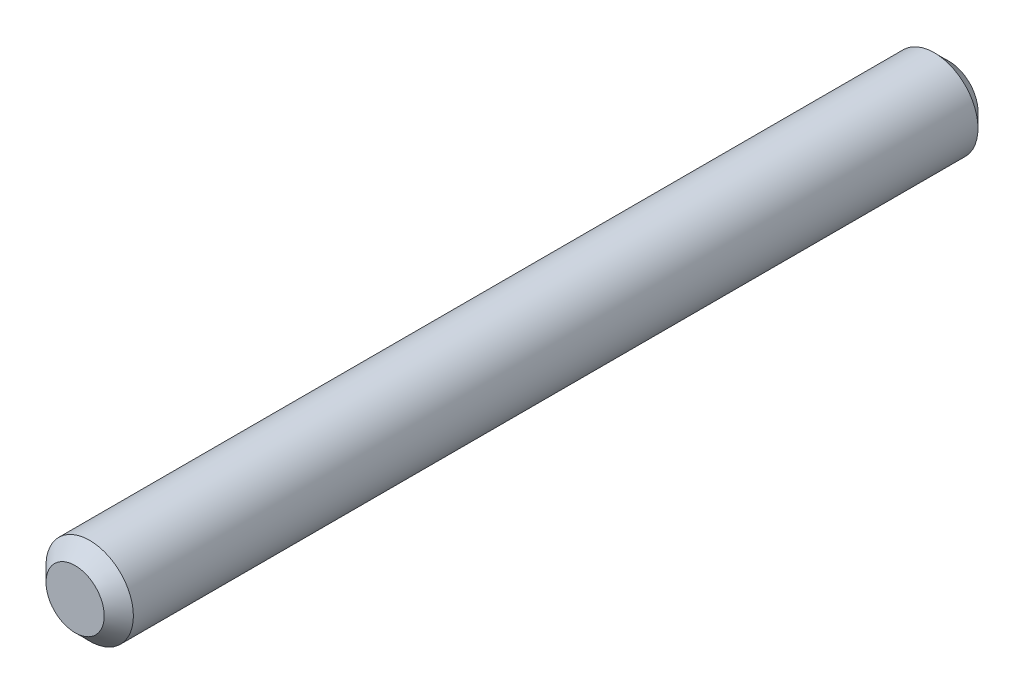
ISO-10303-21;
HEADER;
FILE_DESCRIPTION(('STEP AP214'),'2;1');
FILE_NAME('part.step','',(''),(''),'','','');
FILE_SCHEMA(('AUTOMOTIVE_DESIGN { 1 0 10303 214 1 1 1 1 }'));
ENDSEC;
DATA;
#1=APPLICATION_CONTEXT('core data for automotive mechanical design processes');
#2=APPLICATION_PROTOCOL_DEFINITION('international standard','automotive_design',2000,#1);
#3=PRODUCT_CONTEXT('',#1,'mechanical');
#4=PRODUCT('Part','Part','',(#3));
#5=PRODUCT_RELATED_PRODUCT_CATEGORY('part','',(#4));
#6=PRODUCT_DEFINITION_FORMATION('','',#4);
#7=PRODUCT_DEFINITION_CONTEXT('part definition',#1,'design');
#8=PRODUCT_DEFINITION('design','',#6,#7);
#9=PRODUCT_DEFINITION_SHAPE('','',#8);
#10=(LENGTH_UNIT() NAMED_UNIT(*) SI_UNIT(.MILLI.,.METRE.));
#11=(NAMED_UNIT(*) PLANE_ANGLE_UNIT() SI_UNIT($,.RADIAN.));
#12=(NAMED_UNIT(*) SI_UNIT($,.STERADIAN.) SOLID_ANGLE_UNIT());
#13=UNCERTAINTY_MEASURE_WITH_UNIT(LENGTH_MEASURE(1.E-05),#10,'distance_accuracy_value','');
#14=(GEOMETRIC_REPRESENTATION_CONTEXT(3) GLOBAL_UNCERTAINTY_ASSIGNED_CONTEXT((#13)) GLOBAL_UNIT_ASSIGNED_CONTEXT((#10,
#11,#12)) REPRESENTATION_CONTEXT('',''));
#15=CARTESIAN_POINT('',(0.,0.,0.));
#16=DIRECTION('',(0.,0.,1.));
#17=DIRECTION('',(1.,0.,0.));
#18=AXIS2_PLACEMENT_3D('',#15,#16,#17);
#19=CARTESIAN_POINT('',(0.,0.,30.));
#20=DIRECTION('',(0.,0.,-1.));
#21=DIRECTION('',(-1.,0.,0.));
#22=AXIS2_PLACEMENT_3D('',#19,#20,#21);
#23=CYLINDRICAL_SURFACE('',#22,3.);
#24=CARTESIAN_POINT('',(0.,0.,-29.));
#25=DIRECTION('',(0.,0.,1.));
#26=DIRECTION('',(1.,0.,0.));
#27=AXIS2_PLACEMENT_3D('',#24,#25,#26);
#28=CIRCLE('',#27,3.);
#29=CARTESIAN_POINT('',(3.,0.,-29.));
#30=VERTEX_POINT('',#29);
#31=EDGE_CURVE('E53',#30,#30,#28,.T.);
#32=ORIENTED_EDGE('',*,*,#31,.T.);
#33=EDGE_LOOP('',(#32));
#34=FACE_BOUND('',#33,.T.);
#35=CARTESIAN_POINT('',(0.,0.,29.));
#36=DIRECTION('',(0.,0.,1.));
#37=DIRECTION('',(1.,0.,0.));
#38=AXIS2_PLACEMENT_3D('',#35,#36,#37);
#39=CIRCLE('',#38,3.);
#40=CARTESIAN_POINT('',(3.,0.,29.));
#41=VERTEX_POINT('',#40);
#42=EDGE_CURVE('E59',#41,#41,#39,.F.);
#43=ORIENTED_EDGE('',*,*,#42,.T.);
#44=EDGE_LOOP('',(#43));
#45=FACE_BOUND('',#44,.T.);
#46=ADVANCED_FACE('F44',(#34,#45),#23,.T.);
#47=CARTESIAN_POINT('',(0.,0.,30.));
#48=DIRECTION('',(0.,0.,1.));
#49=DIRECTION('',(1.,0.,0.));
#50=AXIS2_PLACEMENT_3D('',#47,#48,#49);
#51=PLANE('',#50);
#52=CARTESIAN_POINT('',(0.,0.,30.));
#53=DIRECTION('',(0.,0.,1.));
#54=DIRECTION('',(1.,0.,0.));
#55=AXIS2_PLACEMENT_3D('',#52,#53,#54);
#56=CIRCLE('',#55,1.99999999999999);
#57=CARTESIAN_POINT('',(1.99999999999999,0.,30.));
#58=VERTEX_POINT('',#57);
#59=EDGE_CURVE('E65',#58,#58,#56,.T.);
#60=ORIENTED_EDGE('',*,*,#59,.T.);
#61=EDGE_LOOP('',(#60));
#62=FACE_BOUND('',#61,.T.);
#63=ADVANCED_FACE('F73',(#62),#51,.T.);
#64=CARTESIAN_POINT('',(0.,0.,-30.));
#65=DIRECTION('',(0.,0.,1.));
#66=DIRECTION('',(1.,0.,0.));
#67=AXIS2_PLACEMENT_3D('',#64,#65,#66);
#68=PLANE('',#67);
#69=CARTESIAN_POINT('',(0.,0.,-30.));
#70=DIRECTION('',(0.,0.,1.));
#71=DIRECTION('',(1.,0.,0.));
#72=AXIS2_PLACEMENT_3D('',#69,#70,#71);
#73=CIRCLE('',#72,2.);
#74=CARTESIAN_POINT('',(2.,0.,-30.));
#75=VERTEX_POINT('',#74);
#76=EDGE_CURVE('E10',#75,#75,#73,.F.);
#77=ORIENTED_EDGE('',*,*,#76,.T.);
#78=EDGE_LOOP('',(#77));
#79=FACE_BOUND('',#78,.T.);
#80=ADVANCED_FACE('F77',(#79),#68,.F.);
#81=CARTESIAN_POINT('',(0.,0.,30.));
#82=DIRECTION('',(0.,0.,-1.));
#83=DIRECTION('',(-1.,0.,0.));
#84=AXIS2_PLACEMENT_3D('',#81,#82,#83);
#85=CONICAL_SURFACE('',#84,1.99999999999999,0.785398163397451);
#86=ORIENTED_EDGE('',*,*,#42,.F.);
#87=EDGE_LOOP('',(#86));
#88=FACE_BOUND('',#87,.T.);
#89=ORIENTED_EDGE('',*,*,#59,.F.);
#90=EDGE_LOOP('',(#89));
#91=FACE_BOUND('',#90,.T.);
#92=ADVANCED_FACE('F75',(#88,#91),#85,.T.);
#93=CARTESIAN_POINT('',(0.,0.,-29.));
#94=DIRECTION('',(0.,0.,1.));
#95=DIRECTION('',(1.,0.,0.));
#96=AXIS2_PLACEMENT_3D('',#93,#94,#95);
#97=CONICAL_SURFACE('',#96,3.,0.78539816339745);
#98=ORIENTED_EDGE('',*,*,#76,.F.);
#99=EDGE_LOOP('',(#98));
#100=FACE_BOUND('',#99,.T.);
#101=ORIENTED_EDGE('',*,*,#31,.F.);
#102=EDGE_LOOP('',(#101));
#103=FACE_BOUND('',#102,.T.);
#104=ADVANCED_FACE('F47',(#100,#103),#97,.T.);
#105=CLOSED_SHELL('',(#46,#63,#80,#92,#104));
#106=MANIFOLD_SOLID_BREP('B2',#105);
#107=ADVANCED_BREP_SHAPE_REPRESENTATION('',(#18,#106),#14);
#108=SHAPE_DEFINITION_REPRESENTATION(#9,#107);
ENDSEC;
END-ISO-10303-21;
